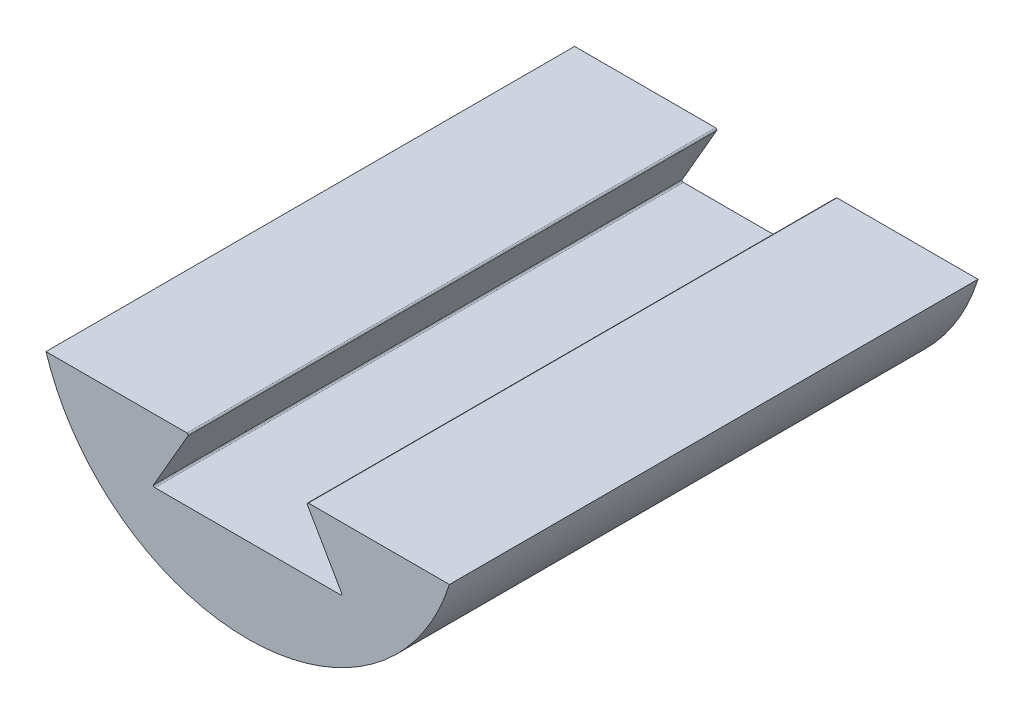
ISO-10303-21;
HEADER;
FILE_DESCRIPTION(('STEP AP214'),'2;1');
FILE_NAME('part.step','',(''),(''),'','','');
FILE_SCHEMA(('AUTOMOTIVE_DESIGN { 1 0 10303 214 1 1 1 1 }'));
ENDSEC;
DATA;
#1=APPLICATION_CONTEXT('core data for automotive mechanical design processes');
#2=APPLICATION_PROTOCOL_DEFINITION('international standard','automotive_design',2000,#1);
#3=PRODUCT_CONTEXT('',#1,'mechanical');
#4=PRODUCT('Part','Part','',(#3));
#5=PRODUCT_RELATED_PRODUCT_CATEGORY('part','',(#4));
#6=PRODUCT_DEFINITION_FORMATION('','',#4);
#7=PRODUCT_DEFINITION_CONTEXT('part definition',#1,'design');
#8=PRODUCT_DEFINITION('design','',#6,#7);
#9=PRODUCT_DEFINITION_SHAPE('','',#8);
#10=(LENGTH_UNIT() NAMED_UNIT(*) SI_UNIT(.MILLI.,.METRE.));
#11=(NAMED_UNIT(*) PLANE_ANGLE_UNIT() SI_UNIT($,.RADIAN.));
#12=(NAMED_UNIT(*) SI_UNIT($,.STERADIAN.) SOLID_ANGLE_UNIT());
#13=UNCERTAINTY_MEASURE_WITH_UNIT(LENGTH_MEASURE(1.E-05),#10,'distance_accuracy_value','');
#14=(GEOMETRIC_REPRESENTATION_CONTEXT(3) GLOBAL_UNCERTAINTY_ASSIGNED_CONTEXT((#13)) GLOBAL_UNIT_ASSIGNED_CONTEXT((#10,
#11,#12)) REPRESENTATION_CONTEXT('',''));
#15=CARTESIAN_POINT('',(0.,0.,0.));
#16=DIRECTION('',(0.,0.,1.));
#17=DIRECTION('',(1.,0.,0.));
#18=AXIS2_PLACEMENT_3D('',#15,#16,#17);
#19=CARTESIAN_POINT('',(-38.1575680566778,-12.,100.));
#20=DIRECTION('',(0.,-1.,0.));
#21=DIRECTION('',(0.,0.,-1.));
#22=AXIS2_PLACEMENT_3D('',#19,#20,#21);
#23=PLANE('',#22);
#24=DIRECTION('',(-1.,0.,0.));
#25=VECTOR('',#24,1.);
#26=CARTESIAN_POINT('',(-38.1575680566778,-12.,100.));
#27=LINE('',#26,#25);
#28=CARTESIAN_POINT('',(-11.5048094716166,-12.,100.));
#29=VERTEX_POINT('',#28);
#30=CARTESIAN_POINT('',(-38.1575680566778,-12.,100.));
#31=VERTEX_POINT('',#30);
#32=EDGE_CURVE('E131',#29,#31,#27,.T.);
#33=ORIENTED_EDGE('',*,*,#32,.F.);
#34=DIRECTION('',(0.,0.,-1.));
#35=VECTOR('',#34,1.);
#36=CARTESIAN_POINT('',(-11.5048094716166,-12.,100.));
#37=LINE('',#36,#35);
#38=CARTESIAN_POINT('',(-11.5048094716166,-12.,0.));
#39=VERTEX_POINT('',#38);
#40=EDGE_CURVE('E160',#29,#39,#37,.T.);
#41=ORIENTED_EDGE('',*,*,#40,.T.);
#42=DIRECTION('',(-1.,0.,0.));
#43=VECTOR('',#42,1.);
#44=CARTESIAN_POINT('',(-38.1575680566778,-12.,0.));
#45=LINE('',#44,#43);
#46=CARTESIAN_POINT('',(-38.1575680566778,-12.,0.));
#47=VERTEX_POINT('',#46);
#48=EDGE_CURVE('E210',#39,#47,#45,.T.);
#49=ORIENTED_EDGE('',*,*,#48,.T.);
#50=DIRECTION('',(0.,0.,-1.));
#51=VECTOR('',#50,1.);
#52=CARTESIAN_POINT('',(-38.1575680566778,-12.,100.));
#53=LINE('',#52,#51);
#54=EDGE_CURVE('E130',#31,#47,#53,.T.);
#55=ORIENTED_EDGE('',*,*,#54,.F.);
#56=EDGE_LOOP('',(#33,#41,#49,#55));
#57=FACE_BOUND('',#56,.T.);
#58=ADVANCED_FACE('F44',(#57),#23,.F.);
#59=CARTESIAN_POINT('',(0.,0.,100.));
#60=DIRECTION('',(0.,0.,-1.));
#61=DIRECTION('',(-1.,0.,0.));
#62=AXIS2_PLACEMENT_3D('',#59,#60,#61);
#63=CYLINDRICAL_SURFACE('',#62,40.);
#64=CARTESIAN_POINT('',(0.,0.,0.));
#65=DIRECTION('',(0.,0.,1.));
#66=DIRECTION('',(1.,0.,0.));
#67=AXIS2_PLACEMENT_3D('',#64,#65,#66);
#68=CIRCLE('',#67,40.);
#69=CARTESIAN_POINT('',(38.1575680566778,-12.,0.));
#70=VERTEX_POINT('',#69);
#71=EDGE_CURVE('E145',#47,#70,#68,.T.);
#72=ORIENTED_EDGE('',*,*,#71,.T.);
#73=DIRECTION('',(0.,0.,-1.));
#74=VECTOR('',#73,1.);
#75=CARTESIAN_POINT('',(38.1575680566778,-12.,100.));
#76=LINE('',#75,#74);
#77=CARTESIAN_POINT('',(38.1575680566778,-12.,100.));
#78=VERTEX_POINT('',#77);
#79=EDGE_CURVE('E126',#78,#70,#76,.T.);
#80=ORIENTED_EDGE('',*,*,#79,.F.);
#81=CARTESIAN_POINT('',(0.,0.,100.));
#82=DIRECTION('',(0.,0.,1.));
#83=DIRECTION('',(1.,0.,0.));
#84=AXIS2_PLACEMENT_3D('',#81,#82,#83);
#85=CIRCLE('',#84,40.);
#86=EDGE_CURVE('E134',#31,#78,#85,.T.);
#87=ORIENTED_EDGE('',*,*,#86,.F.);
#88=ORIENTED_EDGE('',*,*,#54,.T.);
#89=EDGE_LOOP('',(#72,#80,#87,#88));
#90=FACE_BOUND('',#89,.T.);
#91=ADVANCED_FACE('F143',(#90),#63,.T.);
#92=CARTESIAN_POINT('',(11.5048094716166,-12.,0.));
#93=VERTEX_POINT('',#92);
#94=EDGE_CURVE('E141',#70,#93,#45,.T.);
#95=ORIENTED_EDGE('',*,*,#94,.T.);
#96=DIRECTION('',(0.,0.,-1.));
#97=VECTOR('',#96,1.);
#98=CARTESIAN_POINT('',(11.5048094716166,-12.,100.));
#99=LINE('',#98,#97);
#100=CARTESIAN_POINT('',(11.5048094716166,-12.,100.));
#101=VERTEX_POINT('',#100);
#102=EDGE_CURVE('E129',#93,#101,#99,.F.);
#103=ORIENTED_EDGE('',*,*,#102,.T.);
#104=EDGE_CURVE('E121',#78,#101,#27,.T.);
#105=ORIENTED_EDGE('',*,*,#104,.F.);
#106=ORIENTED_EDGE('',*,*,#79,.T.);
#107=EDGE_LOOP('',(#95,#103,#105,#106));
#108=FACE_BOUND('',#107,.T.);
#109=ADVANCED_FACE('F124',(#108),#23,.F.);
#110=CARTESIAN_POINT('',(0.,0.,100.));
#111=DIRECTION('',(0.,0.,1.));
#112=DIRECTION('',(1.,0.,0.));
#113=AXIS2_PLACEMENT_3D('',#110,#111,#112);
#114=PLANE('',#113);
#115=DIRECTION('',(0.500000000000004,0.866025403784436,0.));
#116=VECTOR('',#115,1.);
#117=CARTESIAN_POINT('',(-18.,-24.,100.));
#118=LINE('',#117,#116);
#119=CARTESIAN_POINT('',(-17.7834936490539,-23.625,100.));
#120=VERTEX_POINT('',#119);
#121=CARTESIAN_POINT('',(-11.2883031206705,-12.375,100.));
#122=VERTEX_POINT('',#121);
#123=EDGE_CURVE('E201',#120,#122,#118,.T.);
#124=ORIENTED_EDGE('',*,*,#123,.T.);
#125=CARTESIAN_POINT('',(-11.5048094716166,-12.25,100.));
#126=DIRECTION('',(0.,0.,1.));
#127=DIRECTION('',(1.,0.,0.));
#128=AXIS2_PLACEMENT_3D('',#125,#126,#127);
#129=CIRCLE('',#128,0.25);
#130=EDGE_CURVE('E168',#122,#29,#129,.T.);
#131=ORIENTED_EDGE('',*,*,#130,.T.);
#132=ORIENTED_EDGE('',*,*,#32,.T.);
#133=ORIENTED_EDGE('',*,*,#86,.T.);
#134=ORIENTED_EDGE('',*,*,#104,.T.);
#135=CARTESIAN_POINT('',(11.5048094716166,-12.25,100.));
#136=DIRECTION('',(0.,0.,1.));
#137=DIRECTION('',(1.,0.,0.));
#138=AXIS2_PLACEMENT_3D('',#135,#136,#137);
#139=CIRCLE('',#138,0.25);
#140=CARTESIAN_POINT('',(11.2883031206705,-12.375,100.));
#141=VERTEX_POINT('',#140);
#142=EDGE_CURVE('E66',#101,#141,#139,.T.);
#143=ORIENTED_EDGE('',*,*,#142,.T.);
#144=DIRECTION('',(0.500000000000004,-0.866025403784436,0.));
#145=VECTOR('',#144,1.);
#146=CARTESIAN_POINT('',(11.0717967697244,-12.,100.));
#147=LINE('',#146,#145);
#148=CARTESIAN_POINT('',(17.7834936490539,-23.625,100.));
#149=VERTEX_POINT('',#148);
#150=EDGE_CURVE('E197',#141,#149,#147,.T.);
#151=ORIENTED_EDGE('',*,*,#150,.T.);
#152=CARTESIAN_POINT('',(17.5669872981078,-23.75,100.));
#153=DIRECTION('',(0.,0.,1.));
#154=DIRECTION('',(1.,0.,0.));
#155=AXIS2_PLACEMENT_3D('',#152,#153,#154);
#156=CIRCLE('',#155,0.25);
#157=CARTESIAN_POINT('',(17.5669872981078,-24.,100.));
#158=VERTEX_POINT('',#157);
#159=EDGE_CURVE('E13',#149,#158,#156,.F.);
#160=ORIENTED_EDGE('',*,*,#159,.T.);
#161=DIRECTION('',(-1.,0.,0.));
#162=VECTOR('',#161,1.);
#163=CARTESIAN_POINT('',(18.,-24.,100.));
#164=LINE('',#163,#162);
#165=CARTESIAN_POINT('',(-17.5669872981078,-24.,100.));
#166=VERTEX_POINT('',#165);
#167=EDGE_CURVE('E195',#158,#166,#164,.T.);
#168=ORIENTED_EDGE('',*,*,#167,.T.);
#169=CARTESIAN_POINT('',(-17.5669872981078,-23.75,100.));
#170=DIRECTION('',(0.,0.,1.));
#171=DIRECTION('',(1.,0.,0.));
#172=AXIS2_PLACEMENT_3D('',#169,#170,#171);
#173=CIRCLE('',#172,0.25);
#174=EDGE_CURVE('E177',#166,#120,#173,.F.);
#175=ORIENTED_EDGE('',*,*,#174,.T.);
#176=EDGE_LOOP('',(#124,#131,#132,#133,#134,#143,#151,#160,#168,#175));
#177=FACE_BOUND('',#176,.T.);
#178=ADVANCED_FACE('F136',(#177),#114,.T.);
#179=CARTESIAN_POINT('',(0.,0.,0.));
#180=DIRECTION('',(0.,0.,1.));
#181=DIRECTION('',(1.,0.,0.));
#182=AXIS2_PLACEMENT_3D('',#179,#180,#181);
#183=PLANE('',#182);
#184=ORIENTED_EDGE('',*,*,#48,.F.);
#185=CARTESIAN_POINT('',(-11.5048094716166,-12.25,0.));
#186=DIRECTION('',(0.,0.,1.));
#187=DIRECTION('',(1.,0.,0.));
#188=AXIS2_PLACEMENT_3D('',#185,#186,#187);
#189=CIRCLE('',#188,0.25);
#190=CARTESIAN_POINT('',(-11.2883031206705,-12.375,0.));
#191=VERTEX_POINT('',#190);
#192=EDGE_CURVE('E165',#39,#191,#189,.F.);
#193=ORIENTED_EDGE('',*,*,#192,.T.);
#194=DIRECTION('',(0.500000000000004,0.866025403784436,0.));
#195=VECTOR('',#194,1.);
#196=CARTESIAN_POINT('',(-18.,-24.,0.));
#197=LINE('',#196,#195);
#198=CARTESIAN_POINT('',(-17.7834936490539,-23.625,0.));
#199=VERTEX_POINT('',#198);
#200=EDGE_CURVE('E204',#199,#191,#197,.T.);
#201=ORIENTED_EDGE('',*,*,#200,.F.);
#202=CARTESIAN_POINT('',(-17.5669872981078,-23.75,0.));
#203=DIRECTION('',(0.,0.,1.));
#204=DIRECTION('',(1.,0.,0.));
#205=AXIS2_PLACEMENT_3D('',#202,#203,#204);
#206=CIRCLE('',#205,0.25);
#207=CARTESIAN_POINT('',(-17.5669872981078,-24.,0.));
#208=VERTEX_POINT('',#207);
#209=EDGE_CURVE('E175',#199,#208,#206,.T.);
#210=ORIENTED_EDGE('',*,*,#209,.T.);
#211=DIRECTION('',(-1.,0.,0.));
#212=VECTOR('',#211,1.);
#213=CARTESIAN_POINT('',(18.,-24.,0.));
#214=LINE('',#213,#212);
#215=CARTESIAN_POINT('',(17.5669872981078,-24.,0.));
#216=VERTEX_POINT('',#215);
#217=EDGE_CURVE('E185',#216,#208,#214,.T.);
#218=ORIENTED_EDGE('',*,*,#217,.F.);
#219=CARTESIAN_POINT('',(17.5669872981078,-23.75,0.));
#220=DIRECTION('',(0.,0.,1.));
#221=DIRECTION('',(1.,0.,0.));
#222=AXIS2_PLACEMENT_3D('',#219,#220,#221);
#223=CIRCLE('',#222,0.25);
#224=CARTESIAN_POINT('',(17.7834936490539,-23.625,0.));
#225=VERTEX_POINT('',#224);
#226=EDGE_CURVE('E52',#216,#225,#223,.T.);
#227=ORIENTED_EDGE('',*,*,#226,.T.);
#228=DIRECTION('',(0.500000000000004,-0.866025403784436,0.));
#229=VECTOR('',#228,1.);
#230=CARTESIAN_POINT('',(11.0717967697244,-12.,0.));
#231=LINE('',#230,#229);
#232=CARTESIAN_POINT('',(11.2883031206705,-12.375,0.));
#233=VERTEX_POINT('',#232);
#234=EDGE_CURVE('E183',#233,#225,#231,.T.);
#235=ORIENTED_EDGE('',*,*,#234,.F.);
#236=CARTESIAN_POINT('',(11.5048094716166,-12.25,0.));
#237=DIRECTION('',(0.,0.,1.));
#238=DIRECTION('',(1.,0.,0.));
#239=AXIS2_PLACEMENT_3D('',#236,#237,#238);
#240=CIRCLE('',#239,0.25);
#241=EDGE_CURVE('E163',#233,#93,#240,.F.);
#242=ORIENTED_EDGE('',*,*,#241,.T.);
#243=ORIENTED_EDGE('',*,*,#94,.F.);
#244=ORIENTED_EDGE('',*,*,#71,.F.);
#245=EDGE_LOOP('',(#184,#193,#201,#210,#218,#227,#235,#242,#243,#244));
#246=FACE_BOUND('',#245,.T.);
#247=ADVANCED_FACE('F182',(#246),#183,.F.);
#248=CARTESIAN_POINT('',(-18.,-24.,100.));
#249=DIRECTION('',(-0.866025403784436,0.500000000000004,0.));
#250=DIRECTION('',(-0.500000000000004,-0.866025403784436,0.));
#251=AXIS2_PLACEMENT_3D('',#248,#249,#250);
#252=PLANE('',#251);
#253=ORIENTED_EDGE('',*,*,#123,.F.);
#254=DIRECTION('',(0.,0.,-1.));
#255=VECTOR('',#254,1.);
#256=CARTESIAN_POINT('',(-17.7834936490539,-23.625,0.));
#257=LINE('',#256,#255);
#258=EDGE_CURVE('E148',#120,#199,#257,.T.);
#259=ORIENTED_EDGE('',*,*,#258,.T.);
#260=ORIENTED_EDGE('',*,*,#200,.T.);
#261=DIRECTION('',(0.,0.,-1.));
#262=VECTOR('',#261,1.);
#263=CARTESIAN_POINT('',(-11.2883031206705,-12.375,100.));
#264=LINE('',#263,#262);
#265=EDGE_CURVE('E146',#191,#122,#264,.F.);
#266=ORIENTED_EDGE('',*,*,#265,.T.);
#267=EDGE_LOOP('',(#253,#259,#260,#266));
#268=FACE_BOUND('',#267,.T.);
#269=ADVANCED_FACE('F234',(#268),#252,.F.);
#270=CARTESIAN_POINT('',(18.,-24.,100.));
#271=DIRECTION('',(0.,-1.,0.));
#272=DIRECTION('',(1.,0.,0.));
#273=AXIS2_PLACEMENT_3D('',#270,#271,#272);
#274=PLANE('',#273);
#275=ORIENTED_EDGE('',*,*,#217,.T.);
#276=DIRECTION('',(0.,0.,-1.));
#277=VECTOR('',#276,1.);
#278=CARTESIAN_POINT('',(-17.5669872981078,-24.,100.));
#279=LINE('',#278,#277);
#280=EDGE_CURVE('E158',#208,#166,#279,.F.);
#281=ORIENTED_EDGE('',*,*,#280,.T.);
#282=ORIENTED_EDGE('',*,*,#167,.F.);
#283=DIRECTION('',(0.,0.,-1.));
#284=VECTOR('',#283,1.);
#285=CARTESIAN_POINT('',(17.5669872981078,-24.,0.));
#286=LINE('',#285,#284);
#287=EDGE_CURVE('E155',#158,#216,#286,.T.);
#288=ORIENTED_EDGE('',*,*,#287,.T.);
#289=EDGE_LOOP('',(#275,#281,#282,#288));
#290=FACE_BOUND('',#289,.T.);
#291=ADVANCED_FACE('F199',(#290),#274,.F.);
#292=CARTESIAN_POINT('',(11.0717967697244,-12.,100.));
#293=DIRECTION('',(0.866025403784436,0.500000000000004,0.));
#294=DIRECTION('',(-0.500000000000004,0.866025403784436,0.));
#295=AXIS2_PLACEMENT_3D('',#292,#293,#294);
#296=PLANE('',#295);
#297=ORIENTED_EDGE('',*,*,#234,.T.);
#298=DIRECTION('',(0.,0.,-1.));
#299=VECTOR('',#298,1.);
#300=CARTESIAN_POINT('',(17.7834936490539,-23.625,100.));
#301=LINE('',#300,#299);
#302=EDGE_CURVE('E59',#225,#149,#301,.F.);
#303=ORIENTED_EDGE('',*,*,#302,.T.);
#304=ORIENTED_EDGE('',*,*,#150,.F.);
#305=DIRECTION('',(0.,0.,-1.));
#306=VECTOR('',#305,1.);
#307=CARTESIAN_POINT('',(11.2883031206705,-12.375,100.));
#308=LINE('',#307,#306);
#309=EDGE_CURVE('E170',#141,#233,#308,.T.);
#310=ORIENTED_EDGE('',*,*,#309,.T.);
#311=EDGE_LOOP('',(#297,#303,#304,#310));
#312=FACE_BOUND('',#311,.T.);
#313=ADVANCED_FACE('F188',(#312),#296,.F.);
#314=CARTESIAN_POINT('',(-17.5669872981078,-23.75,100.));
#315=DIRECTION('',(0.,0.,1.));
#316=DIRECTION('',(1.,0.,0.));
#317=AXIS2_PLACEMENT_3D('',#314,#315,#316);
#318=CYLINDRICAL_SURFACE('',#317,0.25);
#319=ORIENTED_EDGE('',*,*,#174,.F.);
#320=ORIENTED_EDGE('',*,*,#280,.F.);
#321=ORIENTED_EDGE('',*,*,#209,.F.);
#322=ORIENTED_EDGE('',*,*,#258,.F.);
#323=EDGE_LOOP('',(#319,#320,#321,#322));
#324=FACE_BOUND('',#323,.T.);
#325=ADVANCED_FACE('F238',(#324),#318,.F.);
#326=CARTESIAN_POINT('',(-11.5048094716166,-12.25,100.));
#327=DIRECTION('',(0.,0.,-1.));
#328=DIRECTION('',(-1.,0.,0.));
#329=AXIS2_PLACEMENT_3D('',#326,#327,#328);
#330=CYLINDRICAL_SURFACE('',#329,0.25);
#331=ORIENTED_EDGE('',*,*,#130,.F.);
#332=ORIENTED_EDGE('',*,*,#265,.F.);
#333=ORIENTED_EDGE('',*,*,#192,.F.);
#334=ORIENTED_EDGE('',*,*,#40,.F.);
#335=EDGE_LOOP('',(#331,#332,#333,#334));
#336=FACE_BOUND('',#335,.T.);
#337=ADVANCED_FACE('F218',(#336),#330,.T.);
#338=CARTESIAN_POINT('',(17.5669872981078,-23.75,100.));
#339=DIRECTION('',(0.,0.,1.));
#340=DIRECTION('',(1.,0.,0.));
#341=AXIS2_PLACEMENT_3D('',#338,#339,#340);
#342=CYLINDRICAL_SURFACE('',#341,0.25);
#343=ORIENTED_EDGE('',*,*,#159,.F.);
#344=ORIENTED_EDGE('',*,*,#302,.F.);
#345=ORIENTED_EDGE('',*,*,#226,.F.);
#346=ORIENTED_EDGE('',*,*,#287,.F.);
#347=EDGE_LOOP('',(#343,#344,#345,#346));
#348=FACE_BOUND('',#347,.T.);
#349=ADVANCED_FACE('F192',(#348),#342,.F.);
#350=CARTESIAN_POINT('',(11.5048094716166,-12.25,100.));
#351=DIRECTION('',(0.,0.,-1.));
#352=DIRECTION('',(-1.,0.,0.));
#353=AXIS2_PLACEMENT_3D('',#350,#351,#352);
#354=CYLINDRICAL_SURFACE('',#353,0.25);
#355=ORIENTED_EDGE('',*,*,#142,.F.);
#356=ORIENTED_EDGE('',*,*,#102,.F.);
#357=ORIENTED_EDGE('',*,*,#241,.F.);
#358=ORIENTED_EDGE('',*,*,#309,.F.);
#359=EDGE_LOOP('',(#355,#356,#357,#358));
#360=FACE_BOUND('',#359,.T.);
#361=ADVANCED_FACE('F46',(#360),#354,.T.);
#362=CLOSED_SHELL('',(#58,#91,#109,#178,#247,#269,#291,#313,#325,#337,#349,#361));
#363=MANIFOLD_SOLID_BREP('B2',#362);
#364=ADVANCED_BREP_SHAPE_REPRESENTATION('',(#18,#363),#14);
#365=SHAPE_DEFINITION_REPRESENTATION(#9,#364);
ENDSEC;
END-ISO-10303-21;
